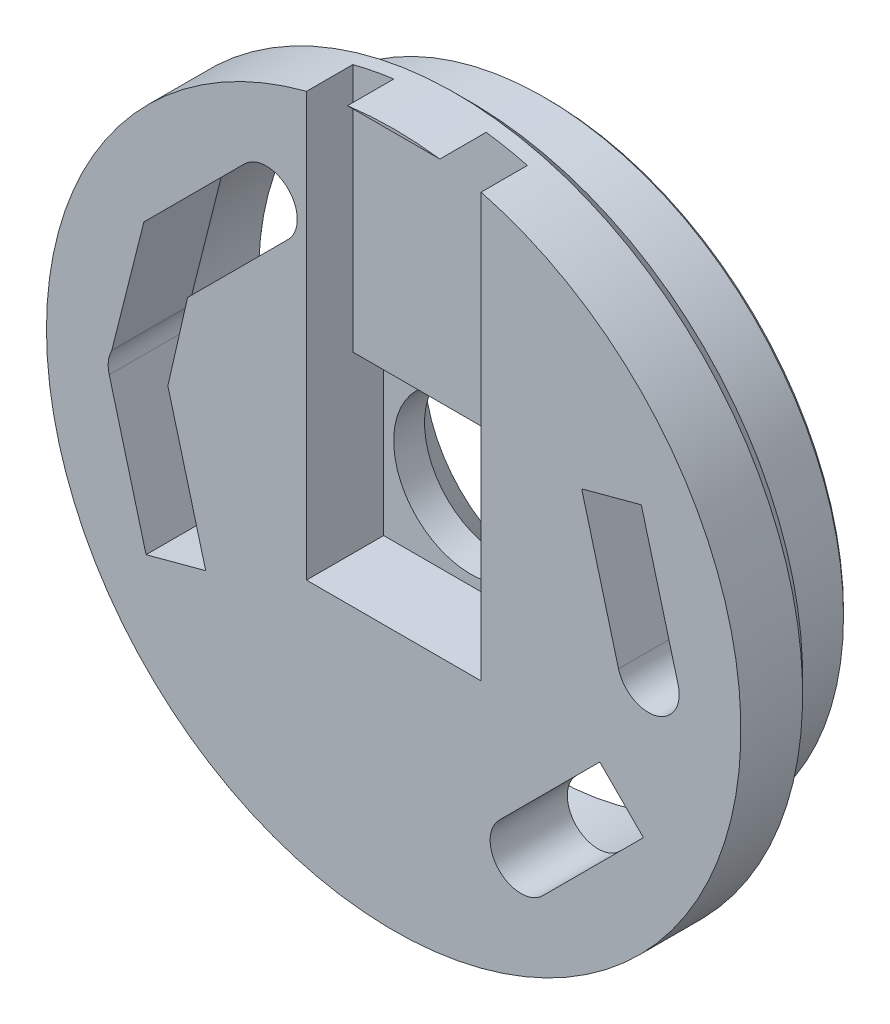
ISO-10303-21;
HEADER;
FILE_DESCRIPTION(('STEP AP214'),'2;1');
FILE_NAME('part.step','',(''),(''),'','','');
FILE_SCHEMA(('AUTOMOTIVE_DESIGN { 1 0 10303 214 1 1 1 1 }'));
ENDSEC;
DATA;
#1=APPLICATION_CONTEXT('core data for automotive mechanical design processes');
#2=APPLICATION_PROTOCOL_DEFINITION('international standard','automotive_design',2000,#1);
#3=PRODUCT_CONTEXT('',#1,'mechanical');
#4=PRODUCT('Part','Part','',(#3));
#5=PRODUCT_RELATED_PRODUCT_CATEGORY('part','',(#4));
#6=PRODUCT_DEFINITION_FORMATION('','',#4);
#7=PRODUCT_DEFINITION_CONTEXT('part definition',#1,'design');
#8=PRODUCT_DEFINITION('design','',#6,#7);
#9=PRODUCT_DEFINITION_SHAPE('','',#8);
#10=(LENGTH_UNIT() NAMED_UNIT(*) SI_UNIT(.MILLI.,.METRE.));
#11=(NAMED_UNIT(*) PLANE_ANGLE_UNIT() SI_UNIT($,.RADIAN.));
#12=(NAMED_UNIT(*) SI_UNIT($,.STERADIAN.) SOLID_ANGLE_UNIT());
#13=UNCERTAINTY_MEASURE_WITH_UNIT(LENGTH_MEASURE(1.E-05),#10,'distance_accuracy_value','');
#14=(GEOMETRIC_REPRESENTATION_CONTEXT(3) GLOBAL_UNCERTAINTY_ASSIGNED_CONTEXT((#13)) GLOBAL_UNIT_ASSIGNED_CONTEXT((#10,
#11,#12)) REPRESENTATION_CONTEXT('',''));
#15=CARTESIAN_POINT('',(0.,0.,0.));
#16=DIRECTION('',(0.,0.,1.));
#17=DIRECTION('',(1.,0.,0.));
#18=AXIS2_PLACEMENT_3D('',#15,#16,#17);
#19=CARTESIAN_POINT('',(-16.5000193663403,-1.99358673371591E-05,10.));
#20=DIRECTION('',(0.,0.,-1.));
#21=DIRECTION('',(-1.,0.,0.));
#22=AXIS2_PLACEMENT_3D('',#19,#20,#21);
#23=CYLINDRICAL_SURFACE('',#22,2.);
#24=CARTESIAN_POINT('',(-16.5000193663403,-1.99358673371591E-05,10.));
#25=DIRECTION('',(0.,0.,-1.));
#26=DIRECTION('',(-0.499999999999992,0.866025403784443,0.));
#27=AXIS2_PLACEMENT_3D('',#24,#25,#26);
#28=CIRCLE('',#27,2.);
#29=CARTESIAN_POINT('',(-14.6389212989369,0.732314675841939,10.));
#30=VERTEX_POINT('',#29);
#31=CARTESIAN_POINT('',(-14.5681683391909,0.51762048846418,10.));
#32=VERTEX_POINT('',#31);
#33=EDGE_CURVE('E454',#30,#32,#28,.T.);
#34=ORIENTED_EDGE('',*,*,#33,.F.);
#35=DIRECTION('',(0.,0.,-1.));
#36=VECTOR('',#35,1.);
#37=CARTESIAN_POINT('',(-14.6389212989369,0.732314675841939,10.));
#38=LINE('',#37,#36);
#39=CARTESIAN_POINT('',(-14.6389212989369,0.73231467584194,5.));
#40=VERTEX_POINT('',#39);
#41=EDGE_CURVE('E11',#30,#40,#38,.T.);
#42=ORIENTED_EDGE('',*,*,#41,.T.);
#43=CARTESIAN_POINT('',(-16.5000193663403,-1.99358673371591E-05,5.));
#44=DIRECTION('',(0.,0.,-1.));
#45=DIRECTION('',(-0.499999999999992,0.866025403784443,0.));
#46=AXIS2_PLACEMENT_3D('',#43,#44,#45);
#47=CIRCLE('',#46,2.);
#48=CARTESIAN_POINT('',(-14.5681683391909,0.517620488464179,5.));
#49=VERTEX_POINT('',#48);
#50=EDGE_CURVE('E265',#40,#49,#47,.T.);
#51=ORIENTED_EDGE('',*,*,#50,.T.);
#52=DIRECTION('',(0.,0.,-1.));
#53=VECTOR('',#52,1.);
#54=CARTESIAN_POINT('',(-14.5681683391909,0.51762048846418,10.));
#55=LINE('',#54,#53);
#56=EDGE_CURVE('E456',#32,#49,#55,.T.);
#57=ORIENTED_EDGE('',*,*,#56,.F.);
#58=EDGE_LOOP('',(#34,#42,#51,#57));
#59=FACE_BOUND('',#58,.T.);
#60=ADVANCED_FACE('F41',(#59),#23,.F.);
#61=CARTESIAN_POINT('',(0.,0.,10.));
#62=DIRECTION('',(0.,0.,1.));
#63=DIRECTION('',(1.,0.,0.));
#64=AXIS2_PLACEMENT_3D('',#61,#62,#63);
#65=PLANE('',#64);
#66=DIRECTION('',(-0.244590784020253,-0.969626396284857,0.));
#67=VECTOR('',#66,1.);
#68=CARTESIAN_POINT('',(-16.1831449656309,9.18471932077773,10.));
#69=LINE('',#68,#67);
#70=CARTESIAN_POINT('',(-16.1831449656309,9.18471932077773,10.));
#71=VERTEX_POINT('',#70);
#72=CARTESIAN_POINT('',(-18.2607207598297,0.94862678602886,10.));
#73=VERTEX_POINT('',#72);
#74=EDGE_CURVE('E227',#71,#73,#69,.T.);
#75=ORIENTED_EDGE('',*,*,#74,.F.);
#76=DIRECTION('',(0.707105926836313,0.70710763553575,0.));
#77=VECTOR('',#76,1.);
#78=CARTESIAN_POINT('',(-16.1831449656309,9.18471932077773,10.));
#79=LINE('',#78,#77);
#80=CARTESIAN_POINT('',(-9.66424221920916,15.7036378199249,10.));
#81=VERTEX_POINT('',#80);
#82=EDGE_CURVE('E245',#71,#81,#79,.T.);
#83=ORIENTED_EDGE('',*,*,#82,.T.);
#84=CARTESIAN_POINT('',(-8.25002694813766,14.2894259662522,10.));
#85=DIRECTION('',(0.,0.,-1.));
#86=DIRECTION('',(0.50000000000001,0.866025403784433,0.));
#87=AXIS2_PLACEMENT_3D('',#84,#85,#86);
#88=CIRCLE('',#87,2.);
#89=CARTESIAN_POINT('',(-6.83581167706615,12.8752141125796,10.));
#90=VERTEX_POINT('',#89);
#91=EDGE_CURVE('E254',#81,#90,#88,.T.);
#92=ORIENTED_EDGE('',*,*,#91,.T.);
#93=DIRECTION('',(-0.707105926836314,-0.707107635535749,0.));
#94=VECTOR('',#93,1.);
#95=CARTESIAN_POINT('',(-6.83581167706615,12.8752141125796,10.));
#96=LINE('',#95,#94);
#97=CARTESIAN_POINT('',(-13.354714423488,6.35629561343248,10.));
#98=VERTEX_POINT('',#97);
#99=EDGE_CURVE('E247',#90,#98,#96,.T.);
#100=ORIENTED_EDGE('',*,*,#99,.T.);
#101=DIRECTION('',(0.222614836657624,0.974906474745091,0.));
#102=VECTOR('',#101,1.);
#103=CARTESIAN_POINT('',(-14.6389212989369,0.732314675841939,10.));
#104=LINE('',#103,#102);
#105=EDGE_CURVE('E243',#30,#98,#104,.T.);
#106=ORIENTED_EDGE('',*,*,#105,.F.);
#107=ORIENTED_EDGE('',*,*,#33,.T.);
#108=DIRECTION('',(0.258820212165752,-0.965925513574662,0.));
#109=VECTOR('',#108,1.);
#110=CARTESIAN_POINT('',(-14.5681683391909,0.51762048846418,10.));
#111=LINE('',#110,#109);
#112=CARTESIAN_POINT('',(-12.1820706869401,-8.38737414431081,10.));
#113=VERTEX_POINT('',#112);
#114=EDGE_CURVE('E453',#32,#113,#111,.T.);
#115=ORIENTED_EDGE('',*,*,#114,.T.);
#116=DIRECTION('',(-0.965925513574662,-0.258820212165752,0.));
#117=VECTOR('',#116,1.);
#118=CARTESIAN_POINT('',(-12.1820706869401,-8.38737414431081,10.));
#119=LINE('',#118,#117);
#120=CARTESIAN_POINT('',(-16.0457727412387,-9.42265499297382,10.));
#121=VERTEX_POINT('',#120);
#122=EDGE_CURVE('E451',#113,#121,#119,.T.);
#123=ORIENTED_EDGE('',*,*,#122,.T.);
#124=DIRECTION('',(-0.258820212165753,0.965925513574662,0.));
#125=VECTOR('',#124,1.);
#126=CARTESIAN_POINT('',(-16.0457727412387,-9.42265499297382,10.));
#127=LINE('',#126,#125);
#128=CARTESIAN_POINT('',(-18.4318703934896,-0.517660360198844,10.));
#129=VERTEX_POINT('',#128);
#130=EDGE_CURVE('E457',#121,#129,#127,.T.);
#131=ORIENTED_EDGE('',*,*,#130,.T.);
#132=EDGE_CURVE('E60',#129,#73,#28,.T.);
#133=ORIENTED_EDGE('',*,*,#132,.T.);
#134=EDGE_LOOP('',(#75,#83,#92,#100,#106,#107,#115,#123,#131,#133));
#135=FACE_BOUND('',#134,.T.);
#136=CARTESIAN_POINT('',(8.25002694813776,-14.2894259662522,10.));
#137=DIRECTION('',(0.,0.,-1.));
#138=DIRECTION('',(-0.500000000000004,-0.866025403784436,0.));
#139=AXIS2_PLACEMENT_3D('',#136,#137,#138);
#140=CIRCLE('',#139,2.);
#141=CARTESIAN_POINT('',(9.66424221920927,-15.7036378199248,10.));
#142=VERTEX_POINT('',#141);
#143=CARTESIAN_POINT('',(6.83581167706624,-12.8752141125796,10.));
#144=VERTEX_POINT('',#143);
#145=EDGE_CURVE('E269',#142,#144,#140,.T.);
#146=ORIENTED_EDGE('',*,*,#145,.T.);
#147=DIRECTION('',(0.707105926836309,0.707107635535754,0.));
#148=VECTOR('',#147,1.);
#149=CARTESIAN_POINT('',(6.83581167706624,-12.8752141125796,10.));
#150=LINE('',#149,#148);
#151=CARTESIAN_POINT('',(13.354714423488,-6.35629561343239,10.));
#152=VERTEX_POINT('',#151);
#153=EDGE_CURVE('E266',#144,#152,#150,.T.);
#154=ORIENTED_EDGE('',*,*,#153,.T.);
#155=DIRECTION('',(0.707107635535754,-0.707105926836309,0.));
#156=VECTOR('',#155,1.);
#157=CARTESIAN_POINT('',(13.354714423488,-6.35629561343239,10.));
#158=LINE('',#157,#156);
#159=CARTESIAN_POINT('',(16.183144965631,-9.18471932077762,10.));
#160=VERTEX_POINT('',#159);
#161=EDGE_CURVE('E274',#152,#160,#158,.T.);
#162=ORIENTED_EDGE('',*,*,#161,.T.);
#163=DIRECTION('',(-0.707105926836308,-0.707107635535755,0.));
#164=VECTOR('',#163,1.);
#165=CARTESIAN_POINT('',(16.183144965631,-9.18471932077762,10.));
#166=LINE('',#165,#164);
#167=EDGE_CURVE('E279',#160,#142,#166,.T.);
#168=ORIENTED_EDGE('',*,*,#167,.T.);
#169=EDGE_LOOP('',(#146,#154,#162,#168));
#170=FACE_BOUND('',#169,.T.);
#171=CARTESIAN_POINT('',(16.5000193663403,1.99358674525182E-05,10.));
#172=DIRECTION('',(0.,0.,-1.));
#173=DIRECTION('',(0.499999999999998,-0.86602540378444,0.));
#174=AXIS2_PLACEMENT_3D('',#171,#172,#173);
#175=CIRCLE('',#174,2.);
#176=CARTESIAN_POINT('',(18.4318703934896,0.517660360198972,10.));
#177=VERTEX_POINT('',#176);
#178=CARTESIAN_POINT('',(14.5681683391909,-0.517620488464078,10.));
#179=VERTEX_POINT('',#178);
#180=EDGE_CURVE('E301',#177,#179,#175,.T.);
#181=ORIENTED_EDGE('',*,*,#180,.T.);
#182=DIRECTION('',(-0.258820212165758,0.96592551357466,0.));
#183=VECTOR('',#182,1.);
#184=CARTESIAN_POINT('',(14.5681683391909,-0.517620488464078,10.));
#185=LINE('',#184,#183);
#186=CARTESIAN_POINT('',(12.18207068694,8.3873741443109,10.));
#187=VERTEX_POINT('',#186);
#188=EDGE_CURVE('E302',#179,#187,#185,.T.);
#189=ORIENTED_EDGE('',*,*,#188,.T.);
#190=DIRECTION('',(0.965925513574661,0.258820212165759,0.));
#191=VECTOR('',#190,1.);
#192=CARTESIAN_POINT('',(12.18207068694,8.3873741443109,10.));
#193=LINE('',#192,#191);
#194=CARTESIAN_POINT('',(16.0457727412387,9.42265499297393,10.));
#195=VERTEX_POINT('',#194);
#196=EDGE_CURVE('E308',#187,#195,#193,.T.);
#197=ORIENTED_EDGE('',*,*,#196,.T.);
#198=DIRECTION('',(0.25882021216576,-0.96592551357466,0.));
#199=VECTOR('',#198,1.);
#200=CARTESIAN_POINT('',(16.0457727412387,9.42265499297393,10.));
#201=LINE('',#200,#199);
#202=EDGE_CURVE('E311',#195,#177,#201,.T.);
#203=ORIENTED_EDGE('',*,*,#202,.T.);
#204=EDGE_LOOP('',(#181,#189,#197,#203));
#205=FACE_BOUND('',#204,.T.);
#206=CARTESIAN_POINT('',(0.,0.,9.99999999999999));
#207=DIRECTION('',(0.,0.,1.));
#208=DIRECTION('',(1.,0.,0.));
#209=AXIS2_PLACEMENT_3D('',#206,#207,#208);
#210=CIRCLE('',#209,22.5);
#211=CARTESIAN_POINT('',(-5.65,21.7790610449578,10.));
#212=VERTEX_POINT('',#211);
#213=CARTESIAN_POINT('',(5.66340872170398,21.7755781014174,10.));
#214=VERTEX_POINT('',#213);
#215=EDGE_CURVE('E343',#212,#214,#210,.T.);
#216=ORIENTED_EDGE('',*,*,#215,.T.);
#217=DIRECTION('',(0.,1.,0.));
#218=VECTOR('',#217,1.);
#219=CARTESIAN_POINT('',(5.66340872170398,5.65,10.));
#220=LINE('',#219,#218);
#221=CARTESIAN_POINT('',(5.66340872170398,5.65,10.));
#222=VERTEX_POINT('',#221);
#223=EDGE_CURVE('E363',#222,#214,#220,.T.);
#224=ORIENTED_EDGE('',*,*,#223,.F.);
#225=DIRECTION('',(1.,0.,0.));
#226=VECTOR('',#225,1.);
#227=CARTESIAN_POINT('',(-5.65,5.65,10.));
#228=LINE('',#227,#226);
#229=CARTESIAN_POINT('',(5.65,5.65,10.));
#230=VERTEX_POINT('',#229);
#231=EDGE_CURVE('E351',#230,#222,#228,.T.);
#232=ORIENTED_EDGE('',*,*,#231,.F.);
#233=DIRECTION('',(0.,1.,0.));
#234=VECTOR('',#233,1.);
#235=CARTESIAN_POINT('',(5.65,5.65,10.));
#236=LINE('',#235,#234);
#237=CARTESIAN_POINT('',(5.65,-5.65,10.));
#238=VERTEX_POINT('',#237);
#239=EDGE_CURVE('E380',#238,#230,#236,.T.);
#240=ORIENTED_EDGE('',*,*,#239,.F.);
#241=DIRECTION('',(1.,0.,0.));
#242=VECTOR('',#241,1.);
#243=CARTESIAN_POINT('',(-5.65,-5.65,10.));
#244=LINE('',#243,#242);
#245=CARTESIAN_POINT('',(-5.65,-5.65,10.));
#246=VERTEX_POINT('',#245);
#247=EDGE_CURVE('E387',#246,#238,#244,.T.);
#248=ORIENTED_EDGE('',*,*,#247,.F.);
#249=DIRECTION('',(0.,-1.,0.));
#250=VECTOR('',#249,1.);
#251=CARTESIAN_POINT('',(-5.65,5.65,10.));
#252=LINE('',#251,#250);
#253=EDGE_CURVE('E375',#212,#246,#252,.T.);
#254=ORIENTED_EDGE('',*,*,#253,.F.);
#255=EDGE_LOOP('',(#216,#224,#232,#240,#248,#254));
#256=FACE_BOUND('',#255,.T.);
#257=ADVANCED_FACE('F237',(#135,#170,#205,#256),#65,.T.);
#258=CARTESIAN_POINT('',(0.,0.,5.));
#259=DIRECTION('',(0.,0.,-1.));
#260=DIRECTION('',(-1.,0.,0.));
#261=AXIS2_PLACEMENT_3D('',#258,#259,#260);
#262=PLANE('',#261);
#263=DIRECTION('',(-0.222614836657624,-0.97490647474509,0.));
#264=VECTOR('',#263,1.);
#265=CARTESIAN_POINT('',(-14.0723881878725,3.21335684907113,5.));
#266=LINE('',#265,#264);
#267=CARTESIAN_POINT('',(-13.354714423488,6.35629561343248,5.));
#268=VERTEX_POINT('',#267);
#269=EDGE_CURVE('E61',#268,#40,#266,.T.);
#270=ORIENTED_EDGE('',*,*,#269,.F.);
#271=DIRECTION('',(-0.707105926836314,-0.707107635535749,0.));
#272=VECTOR('',#271,1.);
#273=CARTESIAN_POINT('',(-6.83581167706615,12.8752141125796,5.));
#274=LINE('',#273,#272);
#275=CARTESIAN_POINT('',(-6.83581167706615,12.8752141125796,5.));
#276=VERTEX_POINT('',#275);
#277=EDGE_CURVE('E260',#276,#268,#274,.T.);
#278=ORIENTED_EDGE('',*,*,#277,.F.);
#279=CARTESIAN_POINT('',(-8.25002694813766,14.2894259662522,5.));
#280=DIRECTION('',(0.,0.,-1.));
#281=DIRECTION('',(0.50000000000001,0.866025403784433,0.));
#282=AXIS2_PLACEMENT_3D('',#279,#280,#281);
#283=CIRCLE('',#282,2.);
#284=CARTESIAN_POINT('',(-9.66424221920916,15.7036378199249,5.));
#285=VERTEX_POINT('',#284);
#286=EDGE_CURVE('E259',#285,#276,#283,.T.);
#287=ORIENTED_EDGE('',*,*,#286,.F.);
#288=DIRECTION('',(0.707105926836313,0.70710763553575,0.));
#289=VECTOR('',#288,1.);
#290=CARTESIAN_POINT('',(-16.1831449656309,9.18471932077773,5.));
#291=LINE('',#290,#289);
#292=CARTESIAN_POINT('',(-16.1831449656309,9.18471932077773,5.));
#293=VERTEX_POINT('',#292);
#294=EDGE_CURVE('E264',#293,#285,#291,.T.);
#295=ORIENTED_EDGE('',*,*,#294,.F.);
#296=DIRECTION('',(0.244590784020253,0.969626396284857,0.));
#297=VECTOR('',#296,1.);
#298=CARTESIAN_POINT('',(-17.3932574246205,4.38749448906733,5.));
#299=LINE('',#298,#297);
#300=CARTESIAN_POINT('',(-18.2607207598297,0.948626786028859,5.));
#301=VERTEX_POINT('',#300);
#302=EDGE_CURVE('E229',#301,#293,#299,.T.);
#303=ORIENTED_EDGE('',*,*,#302,.F.);
#304=CARTESIAN_POINT('',(-18.4318703934896,-0.517660360198844,5.));
#305=VERTEX_POINT('',#304);
#306=EDGE_CURVE('E439',#305,#301,#47,.T.);
#307=ORIENTED_EDGE('',*,*,#306,.F.);
#308=DIRECTION('',(-0.258820212165753,0.965925513574662,0.));
#309=VECTOR('',#308,1.);
#310=CARTESIAN_POINT('',(-16.0457727412387,-9.42265499297382,5.));
#311=LINE('',#310,#309);
#312=CARTESIAN_POINT('',(-16.0457727412387,-9.42265499297382,5.));
#313=VERTEX_POINT('',#312);
#314=EDGE_CURVE('E466',#313,#305,#311,.T.);
#315=ORIENTED_EDGE('',*,*,#314,.F.);
#316=DIRECTION('',(-0.965925513574662,-0.258820212165752,0.));
#317=VECTOR('',#316,1.);
#318=CARTESIAN_POINT('',(-12.1820706869401,-8.38737414431081,5.));
#319=LINE('',#318,#317);
#320=CARTESIAN_POINT('',(-12.1820706869401,-8.38737414431081,5.));
#321=VERTEX_POINT('',#320);
#322=EDGE_CURVE('E461',#321,#313,#319,.T.);
#323=ORIENTED_EDGE('',*,*,#322,.F.);
#324=DIRECTION('',(0.258820212165752,-0.965925513574662,0.));
#325=VECTOR('',#324,1.);
#326=CARTESIAN_POINT('',(-14.5681683391909,0.51762048846418,5.));
#327=LINE('',#326,#325);
#328=EDGE_CURVE('E464',#49,#321,#327,.T.);
#329=ORIENTED_EDGE('',*,*,#328,.F.);
#330=ORIENTED_EDGE('',*,*,#50,.F.);
#331=EDGE_LOOP('',(#270,#278,#287,#295,#303,#307,#315,#323,#329,#330));
#332=FACE_BOUND('',#331,.T.);
#333=CARTESIAN_POINT('',(8.25002694813776,-14.2894259662522,5.));
#334=DIRECTION('',(0.,0.,-1.));
#335=DIRECTION('',(-0.500000000000004,-0.866025403784436,0.));
#336=AXIS2_PLACEMENT_3D('',#333,#334,#335);
#337=CIRCLE('',#336,2.);
#338=CARTESIAN_POINT('',(9.66424221920927,-15.7036378199248,5.));
#339=VERTEX_POINT('',#338);
#340=CARTESIAN_POINT('',(6.83581167706624,-12.8752141125796,5.));
#341=VERTEX_POINT('',#340);
#342=EDGE_CURVE('E283',#339,#341,#337,.T.);
#343=ORIENTED_EDGE('',*,*,#342,.F.);
#344=DIRECTION('',(-0.707105926836308,-0.707107635535755,0.));
#345=VECTOR('',#344,1.);
#346=CARTESIAN_POINT('',(16.183144965631,-9.18471932077762,5.));
#347=LINE('',#346,#345);
#348=CARTESIAN_POINT('',(16.183144965631,-9.18471932077762,5.));
#349=VERTEX_POINT('',#348);
#350=EDGE_CURVE('E272',#349,#339,#347,.T.);
#351=ORIENTED_EDGE('',*,*,#350,.F.);
#352=DIRECTION('',(0.707107635535754,-0.707105926836309,0.));
#353=VECTOR('',#352,1.);
#354=CARTESIAN_POINT('',(13.354714423488,-6.35629561343239,5.));
#355=LINE('',#354,#353);
#356=CARTESIAN_POINT('',(13.354714423488,-6.35629561343239,5.));
#357=VERTEX_POINT('',#356);
#358=EDGE_CURVE('E289',#357,#349,#355,.T.);
#359=ORIENTED_EDGE('',*,*,#358,.F.);
#360=DIRECTION('',(0.707105926836309,0.707107635535754,0.));
#361=VECTOR('',#360,1.);
#362=CARTESIAN_POINT('',(6.83581167706624,-12.8752141125796,5.));
#363=LINE('',#362,#361);
#364=EDGE_CURVE('E282',#341,#357,#363,.T.);
#365=ORIENTED_EDGE('',*,*,#364,.F.);
#366=EDGE_LOOP('',(#343,#351,#359,#365));
#367=FACE_BOUND('',#366,.T.);
#368=CARTESIAN_POINT('',(16.5000193663403,1.99358674525182E-05,5.));
#369=DIRECTION('',(0.,0.,-1.));
#370=DIRECTION('',(0.499999999999998,-0.86602540378444,0.));
#371=AXIS2_PLACEMENT_3D('',#368,#369,#370);
#372=CIRCLE('',#371,2.);
#373=CARTESIAN_POINT('',(18.4318703934896,0.517660360198972,5.));
#374=VERTEX_POINT('',#373);
#375=CARTESIAN_POINT('',(14.5681683391909,-0.517620488464078,5.));
#376=VERTEX_POINT('',#375);
#377=EDGE_CURVE('E295',#374,#376,#372,.T.);
#378=ORIENTED_EDGE('',*,*,#377,.F.);
#379=DIRECTION('',(0.25882021216576,-0.96592551357466,0.));
#380=VECTOR('',#379,1.);
#381=CARTESIAN_POINT('',(16.0457727412387,9.42265499297393,5.));
#382=LINE('',#381,#380);
#383=CARTESIAN_POINT('',(16.0457727412387,9.42265499297393,5.));
#384=VERTEX_POINT('',#383);
#385=EDGE_CURVE('E304',#384,#374,#382,.T.);
#386=ORIENTED_EDGE('',*,*,#385,.F.);
#387=DIRECTION('',(0.965925513574661,0.258820212165759,0.));
#388=VECTOR('',#387,1.);
#389=CARTESIAN_POINT('',(12.18207068694,8.3873741443109,5.));
#390=LINE('',#389,#388);
#391=CARTESIAN_POINT('',(12.18207068694,8.3873741443109,5.));
#392=VERTEX_POINT('',#391);
#393=EDGE_CURVE('E316',#392,#384,#390,.T.);
#394=ORIENTED_EDGE('',*,*,#393,.F.);
#395=DIRECTION('',(-0.258820212165758,0.96592551357466,0.));
#396=VECTOR('',#395,1.);
#397=CARTESIAN_POINT('',(14.5681683391909,-0.517620488464078,5.));
#398=LINE('',#397,#396);
#399=EDGE_CURVE('E317',#376,#392,#398,.T.);
#400=ORIENTED_EDGE('',*,*,#399,.F.);
#401=EDGE_LOOP('',(#378,#386,#394,#400));
#402=FACE_BOUND('',#401,.T.);
#403=CARTESIAN_POINT('',(0.,0.,5.));
#404=DIRECTION('',(0.,0.,-1.));
#405=DIRECTION('',(-1.,0.,0.));
#406=AXIS2_PLACEMENT_3D('',#403,#404,#405);
#407=CIRCLE('',#406,11.25);
#408=CARTESIAN_POINT('',(-11.25,0.,5.));
#409=VERTEX_POINT('',#408);
#410=EDGE_CURVE('E354',#409,#409,#407,.T.);
#411=ORIENTED_EDGE('',*,*,#410,.F.);
#412=EDGE_LOOP('',(#411));
#413=FACE_BOUND('',#412,.T.);
#414=CARTESIAN_POINT('',(0.,0.,5.));
#415=DIRECTION('',(0.,0.,-1.));
#416=DIRECTION('',(-1.,0.,0.));
#417=AXIS2_PLACEMENT_3D('',#414,#415,#416);
#418=CIRCLE('',#417,18.75);
#419=CARTESIAN_POINT('',(-18.75,0.,5.));
#420=VERTEX_POINT('',#419);
#421=EDGE_CURVE('E412',#420,#420,#418,.F.);
#422=ORIENTED_EDGE('',*,*,#421,.F.);
#423=EDGE_LOOP('',(#422));
#424=FACE_BOUND('',#423,.T.);
#425=ADVANCED_FACE('F445',(#332,#367,#402,#413,#424),#262,.T.);
#426=CARTESIAN_POINT('',(-5.65,5.65,5.));
#427=DIRECTION('',(0.,1.,0.));
#428=DIRECTION('',(0.,0.,1.));
#429=AXIS2_PLACEMENT_3D('',#426,#427,#428);
#430=PLANE('',#429);
#431=DIRECTION('',(1.,0.,0.));
#432=VECTOR('',#431,1.);
#433=CARTESIAN_POINT('',(-5.65,5.65,7.));
#434=LINE('',#433,#432);
#435=CARTESIAN_POINT('',(-5.65,5.65,7.));
#436=VERTEX_POINT('',#435);
#437=CARTESIAN_POINT('',(5.65,5.65,7.));
#438=VERTEX_POINT('',#437);
#439=EDGE_CURVE('E365',#436,#438,#434,.T.);
#440=ORIENTED_EDGE('',*,*,#439,.F.);
#441=DIRECTION('',(0.,0.,1.));
#442=VECTOR('',#441,1.);
#443=CARTESIAN_POINT('',(-5.65,5.65,5.));
#444=LINE('',#443,#442);
#445=CARTESIAN_POINT('',(-5.65,5.65,5.));
#446=VERTEX_POINT('',#445);
#447=EDGE_CURVE('E392',#446,#436,#444,.T.);
#448=ORIENTED_EDGE('',*,*,#447,.F.);
#449=DIRECTION('',(-1.,0.,0.));
#450=VECTOR('',#449,1.);
#451=CARTESIAN_POINT('',(-5.65,5.65,5.));
#452=LINE('',#451,#450);
#453=CARTESIAN_POINT('',(5.65,5.65,5.));
#454=VERTEX_POINT('',#453);
#455=EDGE_CURVE('E384',#454,#446,#452,.T.);
#456=ORIENTED_EDGE('',*,*,#455,.F.);
#457=DIRECTION('',(0.,0.,1.));
#458=VECTOR('',#457,1.);
#459=CARTESIAN_POINT('',(5.65,5.65,5.));
#460=LINE('',#459,#458);
#461=EDGE_CURVE('E399',#454,#438,#460,.T.);
#462=ORIENTED_EDGE('',*,*,#461,.T.);
#463=EDGE_LOOP('',(#440,#448,#456,#462));
#464=FACE_BOUND('',#463,.T.);
#465=ADVANCED_FACE('F605',(#464),#430,.F.);
#466=CARTESIAN_POINT('',(0.,0.,10.));
#467=DIRECTION('',(0.,0.,-1.));
#468=DIRECTION('',(-1.,0.,0.));
#469=AXIS2_PLACEMENT_3D('',#466,#467,#468);
#470=CYLINDRICAL_SURFACE('',#469,5.);
#471=CARTESIAN_POINT('',(0.,0.,3.00000000000001));
#472=DIRECTION('',(0.,0.,1.));
#473=DIRECTION('',(1.,0.,0.));
#474=AXIS2_PLACEMENT_3D('',#471,#472,#473);
#475=CIRCLE('',#474,5.);
#476=CARTESIAN_POINT('',(5.,0.,3.00000000000001));
#477=VERTEX_POINT('',#476);
#478=EDGE_CURVE('E406',#477,#477,#475,.F.);
#479=ORIENTED_EDGE('',*,*,#478,.T.);
#480=EDGE_LOOP('',(#479));
#481=FACE_BOUND('',#480,.T.);
#482=CARTESIAN_POINT('',(0.,0.,5.));
#483=DIRECTION('',(0.,0.,1.));
#484=DIRECTION('',(1.,0.,0.));
#485=AXIS2_PLACEMENT_3D('',#482,#483,#484);
#486=CIRCLE('',#485,5.);
#487=CARTESIAN_POINT('',(5.,0.,5.));
#488=VERTEX_POINT('',#487);
#489=EDGE_CURVE('E398',#488,#488,#486,.T.);
#490=ORIENTED_EDGE('',*,*,#489,.T.);
#491=EDGE_LOOP('',(#490));
#492=FACE_BOUND('',#491,.T.);
#493=ADVANCED_FACE('F609',(#481,#492),#470,.F.);
#494=DIRECTION('',(-1.,0.,0.));
#495=VECTOR('',#494,1.);
#496=CARTESIAN_POINT('',(-5.65,22.3,10.));
#497=LINE('',#496,#495);
#498=CARTESIAN_POINT('',(2.99332590941916,22.3,10.));
#499=VERTEX_POINT('',#498);
#500=CARTESIAN_POINT('',(-2.99332590941916,22.3,10.));
#501=VERTEX_POINT('',#500);
#502=EDGE_CURVE('E328',#499,#501,#497,.T.);
#503=ORIENTED_EDGE('',*,*,#502,.F.);
#504=EDGE_CURVE('E345',#499,#501,#210,.T.);
#505=ORIENTED_EDGE('',*,*,#504,.T.);
#506=EDGE_LOOP('',(#503,#505));
#507=FACE_BOUND('',#506,.T.);
#508=ADVANCED_FACE('F517',(#507),#65,.T.);
#509=CARTESIAN_POINT('',(0.,0.,0.));
#510=DIRECTION('',(0.,0.,1.));
#511=DIRECTION('',(1.,0.,0.));
#512=AXIS2_PLACEMENT_3D('',#509,#510,#511);
#513=PLANE('',#512);
#514=CARTESIAN_POINT('',(0.,0.,0.));
#515=DIRECTION('',(0.,0.,1.));
#516=DIRECTION('',(1.,0.,0.));
#517=AXIS2_PLACEMENT_3D('',#514,#515,#516);
#518=CIRCLE('',#517,8.);
#519=CARTESIAN_POINT('',(8.,0.,0.));
#520=VERTEX_POINT('',#519);
#521=EDGE_CURVE('E409',#520,#520,#518,.T.);
#522=ORIENTED_EDGE('',*,*,#521,.T.);
#523=EDGE_LOOP('',(#522));
#524=FACE_BOUND('',#523,.T.);
#525=CARTESIAN_POINT('',(0.,0.,0.));
#526=DIRECTION('',(0.,0.,1.));
#527=DIRECTION('',(1.,0.,0.));
#528=AXIS2_PLACEMENT_3D('',#525,#526,#527);
#529=CIRCLE('',#528,11.25);
#530=CARTESIAN_POINT('',(11.25,0.,0.));
#531=VERTEX_POINT('',#530);
#532=EDGE_CURVE('E353',#531,#531,#529,.T.);
#533=ORIENTED_EDGE('',*,*,#532,.F.);
#534=EDGE_LOOP('',(#533));
#535=FACE_BOUND('',#534,.T.);
#536=ADVANCED_FACE('F620',(#524,#535),#513,.F.);
#537=CARTESIAN_POINT('',(-5.65,5.65,5.));
#538=DIRECTION('',(-1.,0.,0.));
#539=DIRECTION('',(0.,0.,1.));
#540=AXIS2_PLACEMENT_3D('',#537,#538,#539);
#541=PLANE('',#540);
#542=ORIENTED_EDGE('',*,*,#447,.T.);
#543=DIRECTION('',(0.,-1.,0.));
#544=VECTOR('',#543,1.);
#545=CARTESIAN_POINT('',(-5.65,5.65,7.));
#546=LINE('',#545,#544);
#547=CARTESIAN_POINT('',(-5.65,21.7790610449578,7.));
#548=VERTEX_POINT('',#547);
#549=EDGE_CURVE('E356',#548,#436,#546,.T.);
#550=ORIENTED_EDGE('',*,*,#549,.F.);
#551=DIRECTION('',(0.,0.,-1.));
#552=VECTOR('',#551,1.);
#553=CARTESIAN_POINT('',(-5.65,21.7790610449578,6.));
#554=LINE('',#553,#552);
#555=EDGE_CURVE('E422',#548,#212,#554,.F.);
#556=ORIENTED_EDGE('',*,*,#555,.T.);
#557=ORIENTED_EDGE('',*,*,#253,.T.);
#558=DIRECTION('',(0.,0.,1.));
#559=VECTOR('',#558,1.);
#560=CARTESIAN_POINT('',(-5.65,-5.65,5.));
#561=LINE('',#560,#559);
#562=CARTESIAN_POINT('',(-5.65,-5.65,5.));
#563=VERTEX_POINT('',#562);
#564=EDGE_CURVE('E388',#563,#246,#561,.T.);
#565=ORIENTED_EDGE('',*,*,#564,.F.);
#566=DIRECTION('',(0.,-1.,0.));
#567=VECTOR('',#566,1.);
#568=CARTESIAN_POINT('',(-5.65,5.65,5.));
#569=LINE('',#568,#567);
#570=EDGE_CURVE('E373',#446,#563,#569,.T.);
#571=ORIENTED_EDGE('',*,*,#570,.F.);
#572=EDGE_LOOP('',(#542,#550,#556,#557,#565,#571));
#573=FACE_BOUND('',#572,.T.);
#574=ADVANCED_FACE('F614',(#573),#541,.F.);
#575=CARTESIAN_POINT('',(5.65,5.65,5.));
#576=DIRECTION('',(1.,0.,0.));
#577=DIRECTION('',(0.,1.,0.));
#578=AXIS2_PLACEMENT_3D('',#575,#576,#577);
#579=PLANE('',#578);
#580=ORIENTED_EDGE('',*,*,#239,.T.);
#581=EDGE_CURVE('E396',#438,#230,#460,.T.);
#582=ORIENTED_EDGE('',*,*,#581,.F.);
#583=ORIENTED_EDGE('',*,*,#461,.F.);
#584=DIRECTION('',(0.,1.,0.));
#585=VECTOR('',#584,1.);
#586=CARTESIAN_POINT('',(5.65,5.65,5.));
#587=LINE('',#586,#585);
#588=CARTESIAN_POINT('',(5.65,-5.65,5.));
#589=VERTEX_POINT('',#588);
#590=EDGE_CURVE('E379',#589,#454,#587,.T.);
#591=ORIENTED_EDGE('',*,*,#590,.F.);
#592=DIRECTION('',(0.,0.,1.));
#593=VECTOR('',#592,1.);
#594=CARTESIAN_POINT('',(5.65,-5.65,5.));
#595=LINE('',#594,#593);
#596=EDGE_CURVE('E402',#589,#238,#595,.T.);
#597=ORIENTED_EDGE('',*,*,#596,.T.);
#598=EDGE_LOOP('',(#580,#582,#583,#591,#597));
#599=FACE_BOUND('',#598,.T.);
#600=ADVANCED_FACE('F610',(#599),#579,.F.);
#601=CARTESIAN_POINT('',(-5.65,-5.65,5.));
#602=DIRECTION('',(0.,-1.,0.));
#603=DIRECTION('',(0.,0.,-1.));
#604=AXIS2_PLACEMENT_3D('',#601,#602,#603);
#605=PLANE('',#604);
#606=ORIENTED_EDGE('',*,*,#247,.T.);
#607=ORIENTED_EDGE('',*,*,#596,.F.);
#608=DIRECTION('',(1.,0.,0.));
#609=VECTOR('',#608,1.);
#610=CARTESIAN_POINT('',(-5.65,-5.65,5.));
#611=LINE('',#610,#609);
#612=EDGE_CURVE('E376',#563,#589,#611,.T.);
#613=ORIENTED_EDGE('',*,*,#612,.F.);
#614=ORIENTED_EDGE('',*,*,#564,.T.);
#615=EDGE_LOOP('',(#606,#607,#613,#614));
#616=FACE_BOUND('',#615,.T.);
#617=ADVANCED_FACE('F604',(#616),#605,.F.);
#618=CARTESIAN_POINT('',(0.,0.,5.));
#619=DIRECTION('',(0.,0.,1.));
#620=DIRECTION('',(1.,0.,0.));
#621=AXIS2_PLACEMENT_3D('',#618,#619,#620);
#622=PLANE('',#621);
#623=ORIENTED_EDGE('',*,*,#489,.F.);
#624=EDGE_LOOP('',(#623));
#625=FACE_BOUND('',#624,.T.);
#626=ORIENTED_EDGE('',*,*,#570,.T.);
#627=ORIENTED_EDGE('',*,*,#612,.T.);
#628=ORIENTED_EDGE('',*,*,#590,.T.);
#629=ORIENTED_EDGE('',*,*,#455,.T.);
#630=EDGE_LOOP('',(#626,#627,#628,#629));
#631=FACE_BOUND('',#630,.T.);
#632=ADVANCED_FACE('F591',(#625,#631),#622,.T.);
#633=CARTESIAN_POINT('',(5.66340872170398,5.65,7.));
#634=DIRECTION('',(1.,0.,0.));
#635=DIRECTION('',(0.,0.,-1.));
#636=AXIS2_PLACEMENT_3D('',#633,#634,#635);
#637=PLANE('',#636);
#638=ORIENTED_EDGE('',*,*,#223,.T.);
#639=DIRECTION('',(0.,0.,-1.));
#640=VECTOR('',#639,1.);
#641=CARTESIAN_POINT('',(5.66340872170398,21.7755781014174,6.));
#642=LINE('',#641,#640);
#643=CARTESIAN_POINT('',(5.66340872170398,21.7755781014174,7.));
#644=VERTEX_POINT('',#643);
#645=EDGE_CURVE('E429',#214,#644,#642,.T.);
#646=ORIENTED_EDGE('',*,*,#645,.T.);
#647=DIRECTION('',(0.,1.,0.));
#648=VECTOR('',#647,1.);
#649=CARTESIAN_POINT('',(5.66340872170398,5.65,7.));
#650=LINE('',#649,#648);
#651=CARTESIAN_POINT('',(5.66340872170398,5.65,7.));
#652=VERTEX_POINT('',#651);
#653=EDGE_CURVE('E362',#652,#644,#650,.T.);
#654=ORIENTED_EDGE('',*,*,#653,.F.);
#655=DIRECTION('',(0.,0.,1.));
#656=VECTOR('',#655,1.);
#657=CARTESIAN_POINT('',(5.66340872170398,5.65,7.));
#658=LINE('',#657,#656);
#659=EDGE_CURVE('E370',#652,#222,#658,.T.);
#660=ORIENTED_EDGE('',*,*,#659,.T.);
#661=EDGE_LOOP('',(#638,#646,#654,#660));
#662=FACE_BOUND('',#661,.T.);
#663=ADVANCED_FACE('F593',(#662),#637,.F.);
#664=CARTESIAN_POINT('',(0.,0.,7.));
#665=DIRECTION('',(0.,0.,-1.));
#666=DIRECTION('',(-1.,0.,0.));
#667=AXIS2_PLACEMENT_3D('',#664,#665,#666);
#668=PLANE('',#667);
#669=ORIENTED_EDGE('',*,*,#653,.T.);
#670=CARTESIAN_POINT('',(0.,0.,7.));
#671=DIRECTION('',(0.,0.,-1.));
#672=DIRECTION('',(-1.,0.,0.));
#673=AXIS2_PLACEMENT_3D('',#670,#671,#672);
#674=CIRCLE('',#673,22.5);
#675=CARTESIAN_POINT('',(2.99332590941916,22.3,7.));
#676=VERTEX_POINT('',#675);
#677=EDGE_CURVE('E338',#644,#676,#674,.F.);
#678=ORIENTED_EDGE('',*,*,#677,.T.);
#679=DIRECTION('',(-1.,0.,0.));
#680=VECTOR('',#679,1.);
#681=CARTESIAN_POINT('',(-5.65,22.3,7.));
#682=LINE('',#681,#680);
#683=CARTESIAN_POINT('',(-2.99332590941916,22.3,7.));
#684=VERTEX_POINT('',#683);
#685=EDGE_CURVE('E335',#676,#684,#682,.T.);
#686=ORIENTED_EDGE('',*,*,#685,.T.);
#687=EDGE_CURVE('E340',#684,#548,#674,.F.);
#688=ORIENTED_EDGE('',*,*,#687,.T.);
#689=ORIENTED_EDGE('',*,*,#549,.T.);
#690=ORIENTED_EDGE('',*,*,#439,.T.);
#691=EDGE_CURVE('E359',#438,#652,#434,.T.);
#692=ORIENTED_EDGE('',*,*,#691,.T.);
#693=EDGE_LOOP('',(#669,#678,#686,#688,#689,#690,#692));
#694=FACE_BOUND('',#693,.T.);
#695=ADVANCED_FACE('F589',(#694),#668,.F.);
#696=CARTESIAN_POINT('',(-5.65,5.65,7.));
#697=DIRECTION('',(0.,-1.,0.));
#698=DIRECTION('',(0.,0.,-1.));
#699=AXIS2_PLACEMENT_3D('',#696,#697,#698);
#700=PLANE('',#699);
#701=ORIENTED_EDGE('',*,*,#581,.T.);
#702=ORIENTED_EDGE('',*,*,#231,.T.);
#703=ORIENTED_EDGE('',*,*,#659,.F.);
#704=ORIENTED_EDGE('',*,*,#691,.F.);
#705=EDGE_LOOP('',(#701,#702,#703,#704));
#706=FACE_BOUND('',#705,.T.);
#707=ADVANCED_FACE('F586',(#706),#700,.F.);
#708=CARTESIAN_POINT('',(0.,0.,0.));
#709=DIRECTION('',(0.,0.,-1.));
#710=DIRECTION('',(-1.,0.,0.));
#711=AXIS2_PLACEMENT_3D('',#708,#709,#710);
#712=CONICAL_SURFACE('',#711,8.,0.785398163397447);
#713=ORIENTED_EDGE('',*,*,#478,.F.);
#714=EDGE_LOOP('',(#713));
#715=FACE_BOUND('',#714,.T.);
#716=ORIENTED_EDGE('',*,*,#521,.F.);
#717=EDGE_LOOP('',(#716));
#718=FACE_BOUND('',#717,.T.);
#719=ADVANCED_FACE('F581',(#715,#718),#712,.F.);
#720=CARTESIAN_POINT('',(0.,0.,6.));
#721=DIRECTION('',(0.,0.,-1.));
#722=DIRECTION('',(-1.,0.,0.));
#723=AXIS2_PLACEMENT_3D('',#720,#721,#722);
#724=CYLINDRICAL_SURFACE('',#723,22.5);
#725=CARTESIAN_POINT('',(0.,0.,5.99999999999999));
#726=DIRECTION('',(0.,0.,-1.));
#727=DIRECTION('',(-1.,0.,0.));
#728=AXIS2_PLACEMENT_3D('',#725,#726,#727);
#729=CIRCLE('',#728,22.5);
#730=CARTESIAN_POINT('',(-22.5,0.,5.99999999999999));
#731=VERTEX_POINT('',#730);
#732=EDGE_CURVE('E434',#731,#731,#729,.F.);
#733=ORIENTED_EDGE('',*,*,#732,.T.);
#734=EDGE_LOOP('',(#733));
#735=FACE_BOUND('',#734,.T.);
#736=ORIENTED_EDGE('',*,*,#645,.F.);
#737=ORIENTED_EDGE('',*,*,#215,.F.);
#738=ORIENTED_EDGE('',*,*,#555,.F.);
#739=ORIENTED_EDGE('',*,*,#687,.F.);
#740=DIRECTION('',(0.,0.,-1.));
#741=VECTOR('',#740,1.);
#742=CARTESIAN_POINT('',(-2.99332590941916,22.3,6.));
#743=LINE('',#742,#741);
#744=EDGE_CURVE('E424',#501,#684,#743,.T.);
#745=ORIENTED_EDGE('',*,*,#744,.F.);
#746=ORIENTED_EDGE('',*,*,#504,.F.);
#747=DIRECTION('',(0.,0.,-1.));
#748=VECTOR('',#747,1.);
#749=CARTESIAN_POINT('',(2.99332590941916,22.3,6.));
#750=LINE('',#749,#748);
#751=EDGE_CURVE('E430',#676,#499,#750,.F.);
#752=ORIENTED_EDGE('',*,*,#751,.F.);
#753=ORIENTED_EDGE('',*,*,#677,.F.);
#754=EDGE_LOOP('',(#736,#737,#738,#739,#745,#746,#752,#753));
#755=FACE_BOUND('',#754,.T.);
#756=ADVANCED_FACE('F583',(#735,#755),#724,.T.);
#757=CARTESIAN_POINT('',(0.,0.,5.));
#758=DIRECTION('',(0.,0.,-1.));
#759=DIRECTION('',(-1.,0.,0.));
#760=AXIS2_PLACEMENT_3D('',#757,#758,#759);
#761=CIRCLE('',#760,21.5);
#762=CARTESIAN_POINT('',(-21.5,0.,5.));
#763=VERTEX_POINT('',#762);
#764=EDGE_CURVE('E435',#763,#763,#761,.T.);
#765=ORIENTED_EDGE('',*,*,#764,.T.);
#766=EDGE_LOOP('',(#765));
#767=FACE_BOUND('',#766,.T.);
#768=CARTESIAN_POINT('',(0.,0.,5.));
#769=DIRECTION('',(0.,0.,-1.));
#770=DIRECTION('',(-1.,0.,0.));
#771=AXIS2_PLACEMENT_3D('',#768,#769,#770);
#772=CIRCLE('',#771,19.4);
#773=CARTESIAN_POINT('',(-19.4,0.,5.));
#774=VERTEX_POINT('',#773);
#775=EDGE_CURVE('E341',#774,#774,#772,.T.);
#776=ORIENTED_EDGE('',*,*,#775,.F.);
#777=EDGE_LOOP('',(#776));
#778=FACE_BOUND('',#777,.T.);
#779=ADVANCED_FACE('F580',(#767,#778),#262,.T.);
#780=CARTESIAN_POINT('',(0.,0.,-31.8198051533946));
#781=DIRECTION('',(0.,0.,1.));
#782=DIRECTION('',(1.,0.,0.));
#783=AXIS2_PLACEMENT_3D('',#780,#781,#782);
#784=CYLINDRICAL_SURFACE('',#783,11.25);
#785=ORIENTED_EDGE('',*,*,#532,.T.);
#786=EDGE_LOOP('',(#785));
#787=FACE_BOUND('',#786,.T.);
#788=ORIENTED_EDGE('',*,*,#410,.T.);
#789=EDGE_LOOP('',(#788));
#790=FACE_BOUND('',#789,.T.);
#791=ADVANCED_FACE('F566',(#787,#790),#784,.T.);
#792=CARTESIAN_POINT('',(0.,0.,-54.8714862200761));
#793=DIRECTION('',(0.,0.,1.));
#794=DIRECTION('',(1.,0.,0.));
#795=AXIS2_PLACEMENT_3D('',#792,#793,#794);
#796=CYLINDRICAL_SURFACE('',#795,19.4);
#797=CARTESIAN_POINT('',(0.,0.,0.25));
#798=DIRECTION('',(0.,0.,1.));
#799=DIRECTION('',(1.,0.,0.));
#800=AXIS2_PLACEMENT_3D('',#797,#798,#799);
#801=CIRCLE('',#800,19.4);
#802=CARTESIAN_POINT('',(19.4,0.,0.25));
#803=VERTEX_POINT('',#802);
#804=EDGE_CURVE('E418',#803,#803,#801,.T.);
#805=ORIENTED_EDGE('',*,*,#804,.T.);
#806=EDGE_LOOP('',(#805));
#807=FACE_BOUND('',#806,.T.);
#808=ORIENTED_EDGE('',*,*,#775,.T.);
#809=EDGE_LOOP('',(#808));
#810=FACE_BOUND('',#809,.T.);
#811=ADVANCED_FACE('F565',(#807,#810),#796,.T.);
#812=CARTESIAN_POINT('',(0.,0.,-54.8714862200761));
#813=DIRECTION('',(0.,0.,1.));
#814=DIRECTION('',(1.,0.,0.));
#815=AXIS2_PLACEMENT_3D('',#812,#813,#814);
#816=CYLINDRICAL_SURFACE('',#815,18.75);
#817=CARTESIAN_POINT('',(0.,0.,0.));
#818=DIRECTION('',(0.,0.,1.));
#819=DIRECTION('',(1.,0.,0.));
#820=AXIS2_PLACEMENT_3D('',#817,#818,#819);
#821=CIRCLE('',#820,18.75);
#822=CARTESIAN_POINT('',(18.75,0.,0.));
#823=VERTEX_POINT('',#822);
#824=EDGE_CURVE('E347',#823,#823,#821,.T.);
#825=ORIENTED_EDGE('',*,*,#824,.F.);
#826=EDGE_LOOP('',(#825));
#827=FACE_BOUND('',#826,.T.);
#828=ORIENTED_EDGE('',*,*,#421,.T.);
#829=EDGE_LOOP('',(#828));
#830=FACE_BOUND('',#829,.T.);
#831=ADVANCED_FACE('F564',(#827,#830),#816,.F.);
#832=CARTESIAN_POINT('',(0.,0.,0.));
#833=DIRECTION('',(0.,0.,1.));
#834=DIRECTION('',(1.,0.,0.));
#835=AXIS2_PLACEMENT_3D('',#832,#833,#834);
#836=PLANE('',#835);
#837=CARTESIAN_POINT('',(0.,0.,0.));
#838=DIRECTION('',(0.,0.,1.));
#839=DIRECTION('',(1.,0.,0.));
#840=AXIS2_PLACEMENT_3D('',#837,#838,#839);
#841=CIRCLE('',#840,19.15);
#842=CARTESIAN_POINT('',(19.15,0.,0.));
#843=VERTEX_POINT('',#842);
#844=EDGE_CURVE('E420',#843,#843,#841,.F.);
#845=ORIENTED_EDGE('',*,*,#844,.T.);
#846=EDGE_LOOP('',(#845));
#847=FACE_BOUND('',#846,.T.);
#848=ORIENTED_EDGE('',*,*,#824,.T.);
#849=EDGE_LOOP('',(#848));
#850=FACE_BOUND('',#849,.T.);
#851=ADVANCED_FACE('F569',(#847,#850),#836,.F.);
#852=CARTESIAN_POINT('',(0.,0.,0.25));
#853=DIRECTION('',(0.,0.,1.));
#854=DIRECTION('',(1.,0.,0.));
#855=AXIS2_PLACEMENT_3D('',#852,#853,#854);
#856=CONICAL_SURFACE('',#855,19.4,0.785398163397455);
#857=ORIENTED_EDGE('',*,*,#844,.F.);
#858=EDGE_LOOP('',(#857));
#859=FACE_BOUND('',#858,.T.);
#860=ORIENTED_EDGE('',*,*,#804,.F.);
#861=EDGE_LOOP('',(#860));
#862=FACE_BOUND('',#861,.T.);
#863=ADVANCED_FACE('F557',(#859,#862),#856,.T.);
#864=CARTESIAN_POINT('',(-5.65,22.3,-13.1299706135982));
#865=DIRECTION('',(0.,1.,0.));
#866=DIRECTION('',(0.,0.,1.));
#867=AXIS2_PLACEMENT_3D('',#864,#865,#866);
#868=PLANE('',#867);
#869=ORIENTED_EDGE('',*,*,#751,.T.);
#870=ORIENTED_EDGE('',*,*,#502,.T.);
#871=ORIENTED_EDGE('',*,*,#744,.T.);
#872=ORIENTED_EDGE('',*,*,#685,.F.);
#873=EDGE_LOOP('',(#869,#870,#871,#872));
#874=FACE_BOUND('',#873,.T.);
#875=ADVANCED_FACE('F558',(#874),#868,.F.);
#876=CARTESIAN_POINT('',(16.5000193663403,1.99358674525182E-05,10.));
#877=DIRECTION('',(0.,0.,-1.));
#878=DIRECTION('',(-1.,0.,0.));
#879=AXIS2_PLACEMENT_3D('',#876,#877,#878);
#880=CYLINDRICAL_SURFACE('',#879,2.);
#881=ORIENTED_EDGE('',*,*,#377,.T.);
#882=DIRECTION('',(0.,0.,-1.));
#883=VECTOR('',#882,1.);
#884=CARTESIAN_POINT('',(14.5681683391909,-0.517620488464078,10.));
#885=LINE('',#884,#883);
#886=EDGE_CURVE('E313',#179,#376,#885,.T.);
#887=ORIENTED_EDGE('',*,*,#886,.F.);
#888=ORIENTED_EDGE('',*,*,#180,.F.);
#889=DIRECTION('',(0.,0.,-1.));
#890=VECTOR('',#889,1.);
#891=CARTESIAN_POINT('',(18.4318703934896,0.517660360198972,10.));
#892=LINE('',#891,#890);
#893=EDGE_CURVE('E325',#177,#374,#892,.T.);
#894=ORIENTED_EDGE('',*,*,#893,.T.);
#895=EDGE_LOOP('',(#881,#887,#888,#894));
#896=FACE_BOUND('',#895,.T.);
#897=ADVANCED_FACE('F548',(#896),#880,.F.);
#898=CARTESIAN_POINT('',(16.0457727412387,9.42265499297393,10.));
#899=DIRECTION('',(0.96592551357466,0.25882021216576,0.));
#900=DIRECTION('',(-0.25882021216576,0.96592551357466,0.));
#901=AXIS2_PLACEMENT_3D('',#898,#899,#900);
#902=PLANE('',#901);
#903=ORIENTED_EDGE('',*,*,#385,.T.);
#904=ORIENTED_EDGE('',*,*,#893,.F.);
#905=ORIENTED_EDGE('',*,*,#202,.F.);
#906=DIRECTION('',(0.,0.,-1.));
#907=VECTOR('',#906,1.);
#908=CARTESIAN_POINT('',(16.0457727412387,9.42265499297393,10.));
#909=LINE('',#908,#907);
#910=EDGE_CURVE('E329',#195,#384,#909,.T.);
#911=ORIENTED_EDGE('',*,*,#910,.T.);
#912=EDGE_LOOP('',(#903,#904,#905,#911));
#913=FACE_BOUND('',#912,.T.);
#914=ADVANCED_FACE('F544',(#913),#902,.F.);
#915=CARTESIAN_POINT('',(12.18207068694,8.3873741443109,10.));
#916=DIRECTION('',(-0.258820212165759,0.965925513574661,0.));
#917=DIRECTION('',(-0.965925513574661,-0.258820212165759,0.));
#918=AXIS2_PLACEMENT_3D('',#915,#916,#917);
#919=PLANE('',#918);
#920=ORIENTED_EDGE('',*,*,#393,.T.);
#921=ORIENTED_EDGE('',*,*,#910,.F.);
#922=ORIENTED_EDGE('',*,*,#196,.F.);
#923=DIRECTION('',(0.,0.,-1.));
#924=VECTOR('',#923,1.);
#925=CARTESIAN_POINT('',(12.18207068694,8.3873741443109,10.));
#926=LINE('',#925,#924);
#927=EDGE_CURVE('E330',#187,#392,#926,.T.);
#928=ORIENTED_EDGE('',*,*,#927,.T.);
#929=EDGE_LOOP('',(#920,#921,#922,#928));
#930=FACE_BOUND('',#929,.T.);
#931=ADVANCED_FACE('F541',(#930),#919,.F.);
#932=CARTESIAN_POINT('',(14.5681683391909,-0.517620488464078,10.));
#933=DIRECTION('',(-0.965925513574661,-0.258820212165758,0.));
#934=DIRECTION('',(0.258820212165758,-0.965925513574661,0.));
#935=AXIS2_PLACEMENT_3D('',#932,#933,#934);
#936=PLANE('',#935);
#937=ORIENTED_EDGE('',*,*,#399,.T.);
#938=ORIENTED_EDGE('',*,*,#927,.F.);
#939=ORIENTED_EDGE('',*,*,#188,.F.);
#940=ORIENTED_EDGE('',*,*,#886,.T.);
#941=EDGE_LOOP('',(#937,#938,#939,#940));
#942=FACE_BOUND('',#941,.T.);
#943=ADVANCED_FACE('F521',(#942),#936,.F.);
#944=CARTESIAN_POINT('',(-8.25002694813766,14.2894259662522,10.));
#945=DIRECTION('',(0.,0.,-1.));
#946=DIRECTION('',(-1.,0.,0.));
#947=AXIS2_PLACEMENT_3D('',#944,#945,#946);
#948=CYLINDRICAL_SURFACE('',#947,2.);
#949=ORIENTED_EDGE('',*,*,#286,.T.);
#950=DIRECTION('',(0.,0.,-1.));
#951=VECTOR('',#950,1.);
#952=CARTESIAN_POINT('',(-6.83581167706615,12.8752141125796,10.));
#953=LINE('',#952,#951);
#954=EDGE_CURVE('E250',#90,#276,#953,.T.);
#955=ORIENTED_EDGE('',*,*,#954,.F.);
#956=ORIENTED_EDGE('',*,*,#91,.F.);
#957=DIRECTION('',(0.,0.,-1.));
#958=VECTOR('',#957,1.);
#959=CARTESIAN_POINT('',(-9.66424221920916,15.7036378199249,10.));
#960=LINE('',#959,#958);
#961=EDGE_CURVE('E232',#81,#285,#960,.T.);
#962=ORIENTED_EDGE('',*,*,#961,.T.);
#963=EDGE_LOOP('',(#949,#955,#956,#962));
#964=FACE_BOUND('',#963,.T.);
#965=ADVANCED_FACE('F476',(#964),#948,.F.);
#966=CARTESIAN_POINT('',(-16.1831449656309,9.18471932077773,10.));
#967=DIRECTION('',(-0.70710763553575,0.707105926836313,0.));
#968=DIRECTION('',(-0.707105926836313,-0.70710763553575,0.));
#969=AXIS2_PLACEMENT_3D('',#966,#967,#968);
#970=PLANE('',#969);
#971=ORIENTED_EDGE('',*,*,#294,.T.);
#972=ORIENTED_EDGE('',*,*,#961,.F.);
#973=ORIENTED_EDGE('',*,*,#82,.F.);
#974=DIRECTION('',(0.,0.,-1.));
#975=VECTOR('',#974,1.);
#976=CARTESIAN_POINT('',(-16.1831449656309,9.18471932077773,10.));
#977=LINE('',#976,#975);
#978=EDGE_CURVE('E225',#71,#293,#977,.T.);
#979=ORIENTED_EDGE('',*,*,#978,.T.);
#980=EDGE_LOOP('',(#971,#972,#973,#979));
#981=FACE_BOUND('',#980,.T.);
#982=ADVANCED_FACE('F244',(#981),#970,.F.);
#983=CARTESIAN_POINT('',(-6.83581167706615,12.8752141125796,10.));
#984=DIRECTION('',(0.707107635535749,-0.707105926836314,0.));
#985=DIRECTION('',(0.707105926836314,0.707107635535749,0.));
#986=AXIS2_PLACEMENT_3D('',#983,#984,#985);
#987=PLANE('',#986);
#988=ORIENTED_EDGE('',*,*,#277,.T.);
#989=DIRECTION('',(0.,0.,-1.));
#990=VECTOR('',#989,1.);
#991=CARTESIAN_POINT('',(-13.354714423488,6.35629561343248,10.));
#992=LINE('',#991,#990);
#993=EDGE_CURVE('E236',#98,#268,#992,.T.);
#994=ORIENTED_EDGE('',*,*,#993,.F.);
#995=ORIENTED_EDGE('',*,*,#99,.F.);
#996=ORIENTED_EDGE('',*,*,#954,.T.);
#997=EDGE_LOOP('',(#988,#994,#995,#996));
#998=FACE_BOUND('',#997,.T.);
#999=ADVANCED_FACE('F485',(#998),#987,.F.);
#1000=ORIENTED_EDGE('',*,*,#306,.T.);
#1001=DIRECTION('',(0.,0.,-1.));
#1002=VECTOR('',#1001,1.);
#1003=CARTESIAN_POINT('',(-18.2607207598297,0.948626786028859,10.));
#1004=LINE('',#1003,#1002);
#1005=EDGE_CURVE('E49',#301,#73,#1004,.F.);
#1006=ORIENTED_EDGE('',*,*,#1005,.T.);
#1007=ORIENTED_EDGE('',*,*,#132,.F.);
#1008=DIRECTION('',(0.,0.,-1.));
#1009=VECTOR('',#1008,1.);
#1010=CARTESIAN_POINT('',(-18.4318703934896,-0.517660360198844,10.));
#1011=LINE('',#1010,#1009);
#1012=EDGE_CURVE('E285',#129,#305,#1011,.T.);
#1013=ORIENTED_EDGE('',*,*,#1012,.T.);
#1014=EDGE_LOOP('',(#1000,#1006,#1007,#1013));
#1015=FACE_BOUND('',#1014,.T.);
#1016=ADVANCED_FACE('F438',(#1015),#23,.F.);
#1017=CARTESIAN_POINT('',(-16.0457727412387,-9.42265499297382,10.));
#1018=DIRECTION('',(-0.965925513574662,-0.258820212165753,0.));
#1019=DIRECTION('',(0.258820212165753,-0.965925513574662,0.));
#1020=AXIS2_PLACEMENT_3D('',#1017,#1018,#1019);
#1021=PLANE('',#1020);
#1022=ORIENTED_EDGE('',*,*,#314,.T.);
#1023=ORIENTED_EDGE('',*,*,#1012,.F.);
#1024=ORIENTED_EDGE('',*,*,#130,.F.);
#1025=DIRECTION('',(0.,0.,-1.));
#1026=VECTOR('',#1025,1.);
#1027=CARTESIAN_POINT('',(-16.0457727412387,-9.42265499297382,10.));
#1028=LINE('',#1027,#1026);
#1029=EDGE_CURVE('E474',#121,#313,#1028,.T.);
#1030=ORIENTED_EDGE('',*,*,#1029,.T.);
#1031=EDGE_LOOP('',(#1022,#1023,#1024,#1030));
#1032=FACE_BOUND('',#1031,.T.);
#1033=ADVANCED_FACE('F499',(#1032),#1021,.F.);
#1034=CARTESIAN_POINT('',(-12.1820706869401,-8.38737414431081,10.));
#1035=DIRECTION('',(0.258820212165752,-0.965925513574662,0.));
#1036=DIRECTION('',(0.965925513574662,0.258820212165752,0.));
#1037=AXIS2_PLACEMENT_3D('',#1034,#1035,#1036);
#1038=PLANE('',#1037);
#1039=ORIENTED_EDGE('',*,*,#322,.T.);
#1040=ORIENTED_EDGE('',*,*,#1029,.F.);
#1041=ORIENTED_EDGE('',*,*,#122,.F.);
#1042=DIRECTION('',(0.,0.,-1.));
#1043=VECTOR('',#1042,1.);
#1044=CARTESIAN_POINT('',(-12.1820706869401,-8.38737414431081,10.));
#1045=LINE('',#1044,#1043);
#1046=EDGE_CURVE('E475',#113,#321,#1045,.T.);
#1047=ORIENTED_EDGE('',*,*,#1046,.T.);
#1048=EDGE_LOOP('',(#1039,#1040,#1041,#1047));
#1049=FACE_BOUND('',#1048,.T.);
#1050=ADVANCED_FACE('F498',(#1049),#1038,.F.);
#1051=CARTESIAN_POINT('',(-14.5681683391909,0.51762048846418,10.));
#1052=DIRECTION('',(0.965925513574662,0.258820212165752,0.));
#1053=DIRECTION('',(-0.258820212165752,0.965925513574663,0.));
#1054=AXIS2_PLACEMENT_3D('',#1051,#1052,#1053);
#1055=PLANE('',#1054);
#1056=ORIENTED_EDGE('',*,*,#328,.T.);
#1057=ORIENTED_EDGE('',*,*,#1046,.F.);
#1058=ORIENTED_EDGE('',*,*,#114,.F.);
#1059=ORIENTED_EDGE('',*,*,#56,.T.);
#1060=EDGE_LOOP('',(#1056,#1057,#1058,#1059));
#1061=FACE_BOUND('',#1060,.T.);
#1062=ADVANCED_FACE('F494',(#1061),#1055,.F.);
#1063=CARTESIAN_POINT('',(8.25002694813776,-14.2894259662522,10.));
#1064=DIRECTION('',(0.,0.,-1.));
#1065=DIRECTION('',(-1.,0.,0.));
#1066=AXIS2_PLACEMENT_3D('',#1063,#1064,#1065);
#1067=CYLINDRICAL_SURFACE('',#1066,2.);
#1068=ORIENTED_EDGE('',*,*,#342,.T.);
#1069=DIRECTION('',(0.,0.,-1.));
#1070=VECTOR('',#1069,1.);
#1071=CARTESIAN_POINT('',(6.83581167706624,-12.8752141125796,10.));
#1072=LINE('',#1071,#1070);
#1073=EDGE_CURVE('E276',#144,#341,#1072,.T.);
#1074=ORIENTED_EDGE('',*,*,#1073,.F.);
#1075=ORIENTED_EDGE('',*,*,#145,.F.);
#1076=DIRECTION('',(0.,0.,-1.));
#1077=VECTOR('',#1076,1.);
#1078=CARTESIAN_POINT('',(9.66424221920927,-15.7036378199248,10.));
#1079=LINE('',#1078,#1077);
#1080=EDGE_CURVE('E292',#142,#339,#1079,.T.);
#1081=ORIENTED_EDGE('',*,*,#1080,.T.);
#1082=EDGE_LOOP('',(#1068,#1074,#1075,#1081));
#1083=FACE_BOUND('',#1082,.T.);
#1084=ADVANCED_FACE('F526',(#1083),#1067,.F.);
#1085=CARTESIAN_POINT('',(16.183144965631,-9.18471932077762,10.));
#1086=DIRECTION('',(0.707107635535755,-0.707105926836308,0.));
#1087=DIRECTION('',(0.707105926836308,0.707107635535755,0.));
#1088=AXIS2_PLACEMENT_3D('',#1085,#1086,#1087);
#1089=PLANE('',#1088);
#1090=ORIENTED_EDGE('',*,*,#350,.T.);
#1091=ORIENTED_EDGE('',*,*,#1080,.F.);
#1092=ORIENTED_EDGE('',*,*,#167,.F.);
#1093=DIRECTION('',(0.,0.,-1.));
#1094=VECTOR('',#1093,1.);
#1095=CARTESIAN_POINT('',(16.183144965631,-9.18471932077762,10.));
#1096=LINE('',#1095,#1094);
#1097=EDGE_CURVE('E294',#160,#349,#1096,.T.);
#1098=ORIENTED_EDGE('',*,*,#1097,.T.);
#1099=EDGE_LOOP('',(#1090,#1091,#1092,#1098));
#1100=FACE_BOUND('',#1099,.T.);
#1101=ADVANCED_FACE('F528',(#1100),#1089,.F.);
#1102=CARTESIAN_POINT('',(13.354714423488,-6.35629561343239,10.));
#1103=DIRECTION('',(0.707105926836309,0.707107635535754,0.));
#1104=DIRECTION('',(-0.707107635535754,0.707105926836309,0.));
#1105=AXIS2_PLACEMENT_3D('',#1102,#1103,#1104);
#1106=PLANE('',#1105);
#1107=ORIENTED_EDGE('',*,*,#358,.T.);
#1108=ORIENTED_EDGE('',*,*,#1097,.F.);
#1109=ORIENTED_EDGE('',*,*,#161,.F.);
#1110=DIRECTION('',(0.,0.,-1.));
#1111=VECTOR('',#1110,1.);
#1112=CARTESIAN_POINT('',(13.354714423488,-6.35629561343239,10.));
#1113=LINE('',#1112,#1111);
#1114=EDGE_CURVE('E300',#152,#357,#1113,.T.);
#1115=ORIENTED_EDGE('',*,*,#1114,.T.);
#1116=EDGE_LOOP('',(#1107,#1108,#1109,#1115));
#1117=FACE_BOUND('',#1116,.T.);
#1118=ADVANCED_FACE('F530',(#1117),#1106,.F.);
#1119=CARTESIAN_POINT('',(6.83581167706624,-12.8752141125796,10.));
#1120=DIRECTION('',(-0.707107635535754,0.707105926836309,0.));
#1121=DIRECTION('',(-0.707105926836309,-0.707107635535754,0.));
#1122=AXIS2_PLACEMENT_3D('',#1119,#1120,#1121);
#1123=PLANE('',#1122);
#1124=ORIENTED_EDGE('',*,*,#364,.T.);
#1125=ORIENTED_EDGE('',*,*,#1114,.F.);
#1126=ORIENTED_EDGE('',*,*,#153,.F.);
#1127=ORIENTED_EDGE('',*,*,#1073,.T.);
#1128=EDGE_LOOP('',(#1124,#1125,#1126,#1127));
#1129=FACE_BOUND('',#1128,.T.);
#1130=ADVANCED_FACE('F534',(#1129),#1123,.F.);
#1131=CARTESIAN_POINT('',(0.,0.,5.));
#1132=DIRECTION('',(0.,0.,1.));
#1133=DIRECTION('',(1.,0.,0.));
#1134=AXIS2_PLACEMENT_3D('',#1131,#1132,#1133);
#1135=CONICAL_SURFACE('',#1134,21.5,0.785398163397448);
#1136=ORIENTED_EDGE('',*,*,#732,.F.);
#1137=EDGE_LOOP('',(#1136));
#1138=FACE_BOUND('',#1137,.T.);
#1139=ORIENTED_EDGE('',*,*,#764,.F.);
#1140=EDGE_LOOP('',(#1139));
#1141=FACE_BOUND('',#1140,.T.);
#1142=ADVANCED_FACE('F42',(#1138,#1141),#1135,.T.);
#1143=CARTESIAN_POINT('',(-16.1831449656309,9.18471932077773,0.));
#1144=DIRECTION('',(-0.969626396284857,0.244590784020253,0.));
#1145=DIRECTION('',(-0.244590784020253,-0.969626396284857,0.));
#1146=AXIS2_PLACEMENT_3D('',#1143,#1144,#1145);
#1147=PLANE('',#1146);
#1148=ORIENTED_EDGE('',*,*,#302,.T.);
#1149=ORIENTED_EDGE('',*,*,#978,.F.);
#1150=ORIENTED_EDGE('',*,*,#74,.T.);
#1151=ORIENTED_EDGE('',*,*,#1005,.F.);
#1152=EDGE_LOOP('',(#1148,#1149,#1150,#1151));
#1153=FACE_BOUND('',#1152,.T.);
#1154=ADVANCED_FACE('F221',(#1153),#1147,.F.);
#1155=CARTESIAN_POINT('',(-14.6389212989369,0.732314675841939,0.));
#1156=DIRECTION('',(0.97490647474509,-0.222614836657624,0.));
#1157=DIRECTION('',(0.222614836657624,0.97490647474509,0.));
#1158=AXIS2_PLACEMENT_3D('',#1155,#1156,#1157);
#1159=PLANE('',#1158);
#1160=ORIENTED_EDGE('',*,*,#269,.T.);
#1161=ORIENTED_EDGE('',*,*,#41,.F.);
#1162=ORIENTED_EDGE('',*,*,#105,.T.);
#1163=ORIENTED_EDGE('',*,*,#993,.T.);
#1164=EDGE_LOOP('',(#1160,#1161,#1162,#1163));
#1165=FACE_BOUND('',#1164,.T.);
#1166=ADVANCED_FACE('F481',(#1165),#1159,.F.);
#1167=CLOSED_SHELL('',(#60,#257,#425,#465,#493,#508,#536,#574,#600,#617,#632,#663,#695,#707,
#719,#756,#779,#791,#811,#831,#851,#863,#875,#897,#914,#931,#943,#965,#982,#999,#1016,#1033,
#1050,#1062,#1084,#1101,#1118,#1130,#1142,#1154,#1166));
#1168=MANIFOLD_SOLID_BREP('B2',#1167);
#1169=ADVANCED_BREP_SHAPE_REPRESENTATION('',(#18,#1168),#14);
#1170=SHAPE_DEFINITION_REPRESENTATION(#9,#1169);
ENDSEC;
END-ISO-10303-21;
